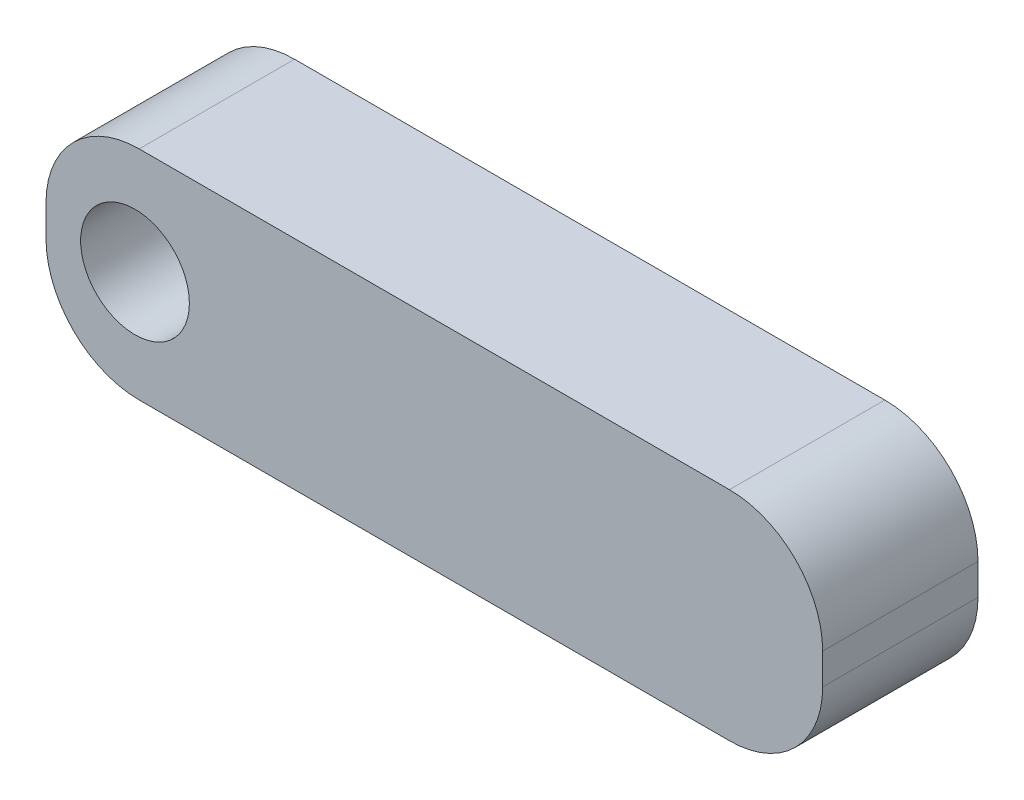
ISO-10303-21;
HEADER;
FILE_DESCRIPTION(('STEP AP214'),'2;1');
FILE_NAME('part.step','',(''),(''),'','','');
FILE_SCHEMA(('AUTOMOTIVE_DESIGN { 1 0 10303 214 1 1 1 1 }'));
ENDSEC;
DATA;
#1=APPLICATION_CONTEXT('core data for automotive mechanical design processes');
#2=APPLICATION_PROTOCOL_DEFINITION('international standard','automotive_design',2000,#1);
#3=PRODUCT_CONTEXT('',#1,'mechanical');
#4=PRODUCT('Part','Part','',(#3));
#5=PRODUCT_RELATED_PRODUCT_CATEGORY('part','',(#4));
#6=PRODUCT_DEFINITION_FORMATION('','',#4);
#7=PRODUCT_DEFINITION_CONTEXT('part definition',#1,'design');
#8=PRODUCT_DEFINITION('design','',#6,#7);
#9=PRODUCT_DEFINITION_SHAPE('','',#8);
#10=(LENGTH_UNIT() NAMED_UNIT(*) SI_UNIT(.MILLI.,.METRE.));
#11=(NAMED_UNIT(*) PLANE_ANGLE_UNIT() SI_UNIT($,.RADIAN.));
#12=(NAMED_UNIT(*) SI_UNIT($,.STERADIAN.) SOLID_ANGLE_UNIT());
#13=UNCERTAINTY_MEASURE_WITH_UNIT(LENGTH_MEASURE(1.E-05),#10,'distance_accuracy_value','');
#14=(GEOMETRIC_REPRESENTATION_CONTEXT(3) GLOBAL_UNCERTAINTY_ASSIGNED_CONTEXT((#13)) GLOBAL_UNIT_ASSIGNED_CONTEXT((#10,
#11,#12)) REPRESENTATION_CONTEXT('',''));
#15=CARTESIAN_POINT('',(0.,0.,0.));
#16=DIRECTION('',(0.,0.,1.));
#17=DIRECTION('',(1.,0.,0.));
#18=AXIS2_PLACEMENT_3D('',#15,#16,#17);
#19=CARTESIAN_POINT('',(0.,0.,5.));
#20=DIRECTION('',(0.,0.,-1.));
#21=DIRECTION('',(-1.,0.,0.));
#22=AXIS2_PLACEMENT_3D('',#19,#20,#21);
#23=PLANE('',#22);
#24=DIRECTION('',(0.,1.,0.));
#25=VECTOR('',#24,1.);
#26=CARTESIAN_POINT('',(12.5,-3.5,5.));
#27=LINE('',#26,#25);
#28=CARTESIAN_POINT('',(12.5,-0.5,5.));
#29=VERTEX_POINT('',#28);
#30=CARTESIAN_POINT('',(12.5,0.500000000000001,5.));
#31=VERTEX_POINT('',#30);
#32=EDGE_CURVE('E129',#29,#31,#27,.T.);
#33=ORIENTED_EDGE('',*,*,#32,.T.);
#34=CARTESIAN_POINT('',(9.50000000000001,0.500000000000001,5.));
#35=DIRECTION('',(0.,0.,-1.));
#36=DIRECTION('',(-1.,0.,0.));
#37=AXIS2_PLACEMENT_3D('',#34,#35,#36);
#38=CIRCLE('',#37,3.);
#39=CARTESIAN_POINT('',(9.50000000000001,3.5,5.));
#40=VERTEX_POINT('',#39);
#41=EDGE_CURVE('E41',#31,#40,#38,.F.);
#42=ORIENTED_EDGE('',*,*,#41,.T.);
#43=DIRECTION('',(-1.,0.,0.));
#44=VECTOR('',#43,1.);
#45=CARTESIAN_POINT('',(-12.5,3.5,5.));
#46=LINE('',#45,#44);
#47=CARTESIAN_POINT('',(-9.5,3.5,5.));
#48=VERTEX_POINT('',#47);
#49=EDGE_CURVE('E162',#40,#48,#46,.T.);
#50=ORIENTED_EDGE('',*,*,#49,.T.);
#51=CARTESIAN_POINT('',(-9.5,0.500000000000001,5.));
#52=DIRECTION('',(0.,0.,-1.));
#53=DIRECTION('',(-1.,0.,0.));
#54=AXIS2_PLACEMENT_3D('',#51,#52,#53);
#55=CIRCLE('',#54,3.);
#56=CARTESIAN_POINT('',(-12.5,0.500000000000001,5.));
#57=VERTEX_POINT('',#56);
#58=EDGE_CURVE('E141',#48,#57,#55,.F.);
#59=ORIENTED_EDGE('',*,*,#58,.T.);
#60=DIRECTION('',(0.,-1.,0.));
#61=VECTOR('',#60,1.);
#62=CARTESIAN_POINT('',(-12.5,-3.5,5.));
#63=LINE('',#62,#61);
#64=CARTESIAN_POINT('',(-12.5,-0.5,5.));
#65=VERTEX_POINT('',#64);
#66=EDGE_CURVE('E120',#57,#65,#63,.T.);
#67=ORIENTED_EDGE('',*,*,#66,.T.);
#68=CARTESIAN_POINT('',(-9.5,-0.5,5.));
#69=DIRECTION('',(0.,0.,-1.));
#70=DIRECTION('',(-1.,0.,0.));
#71=AXIS2_PLACEMENT_3D('',#68,#69,#70);
#72=CIRCLE('',#71,3.);
#73=CARTESIAN_POINT('',(-9.5,-3.5,5.));
#74=VERTEX_POINT('',#73);
#75=EDGE_CURVE('E139',#65,#74,#72,.F.);
#76=ORIENTED_EDGE('',*,*,#75,.T.);
#77=DIRECTION('',(1.,0.,0.));
#78=VECTOR('',#77,1.);
#79=CARTESIAN_POINT('',(-12.5,-3.5,5.));
#80=LINE('',#79,#78);
#81=CARTESIAN_POINT('',(9.50000000000001,-3.5,5.));
#82=VERTEX_POINT('',#81);
#83=EDGE_CURVE('E135',#74,#82,#80,.T.);
#84=ORIENTED_EDGE('',*,*,#83,.T.);
#85=CARTESIAN_POINT('',(9.50000000000001,-0.5,5.));
#86=DIRECTION('',(0.,0.,-1.));
#87=DIRECTION('',(-1.,0.,0.));
#88=AXIS2_PLACEMENT_3D('',#85,#86,#87);
#89=CIRCLE('',#88,3.);
#90=EDGE_CURVE('E157',#82,#29,#89,.F.);
#91=ORIENTED_EDGE('',*,*,#90,.T.);
#92=EDGE_LOOP('',(#33,#42,#50,#59,#67,#76,#84,#91));
#93=FACE_BOUND('',#92,.T.);
#94=CARTESIAN_POINT('',(-9.63541666666667,0.,5.));
#95=DIRECTION('',(0.,0.,1.));
#96=DIRECTION('',(1.,0.,0.));
#97=AXIS2_PLACEMENT_3D('',#94,#95,#96);
#98=CIRCLE('',#97,1.75);
#99=CARTESIAN_POINT('',(-7.88541666666667,0.,5.));
#100=VERTEX_POINT('',#99);
#101=EDGE_CURVE('E172',#100,#100,#98,.T.);
#102=ORIENTED_EDGE('',*,*,#101,.F.);
#103=EDGE_LOOP('',(#102));
#104=FACE_BOUND('',#103,.T.);
#105=ADVANCED_FACE('F33',(#93,#104),#23,.F.);
#106=CARTESIAN_POINT('',(0.,0.,0.));
#107=DIRECTION('',(0.,0.,-1.));
#108=DIRECTION('',(-1.,0.,0.));
#109=AXIS2_PLACEMENT_3D('',#106,#107,#108);
#110=PLANE('',#109);
#111=DIRECTION('',(-1.,0.,0.));
#112=VECTOR('',#111,1.);
#113=CARTESIAN_POINT('',(-12.5,3.5,0.));
#114=LINE('',#113,#112);
#115=CARTESIAN_POINT('',(9.50000000000001,3.5,0.));
#116=VERTEX_POINT('',#115);
#117=CARTESIAN_POINT('',(-9.5,3.5,0.));
#118=VERTEX_POINT('',#117);
#119=EDGE_CURVE('E127',#116,#118,#114,.T.);
#120=ORIENTED_EDGE('',*,*,#119,.F.);
#121=CARTESIAN_POINT('',(9.50000000000001,0.500000000000001,0.));
#122=DIRECTION('',(0.,0.,-1.));
#123=DIRECTION('',(-1.,0.,0.));
#124=AXIS2_PLACEMENT_3D('',#121,#122,#123);
#125=CIRCLE('',#124,3.);
#126=CARTESIAN_POINT('',(12.5,0.500000000000001,0.));
#127=VERTEX_POINT('',#126);
#128=EDGE_CURVE('E151',#116,#127,#125,.T.);
#129=ORIENTED_EDGE('',*,*,#128,.T.);
#130=DIRECTION('',(0.,1.,0.));
#131=VECTOR('',#130,1.);
#132=CARTESIAN_POINT('',(12.5,-3.5,0.));
#133=LINE('',#132,#131);
#134=CARTESIAN_POINT('',(12.5,-0.5,0.));
#135=VERTEX_POINT('',#134);
#136=EDGE_CURVE('E131',#135,#127,#133,.T.);
#137=ORIENTED_EDGE('',*,*,#136,.F.);
#138=CARTESIAN_POINT('',(9.50000000000001,-0.5,0.));
#139=DIRECTION('',(0.,0.,-1.));
#140=DIRECTION('',(-1.,0.,0.));
#141=AXIS2_PLACEMENT_3D('',#138,#139,#140);
#142=CIRCLE('',#141,3.);
#143=CARTESIAN_POINT('',(9.50000000000001,-3.5,0.));
#144=VERTEX_POINT('',#143);
#145=EDGE_CURVE('E149',#135,#144,#142,.T.);
#146=ORIENTED_EDGE('',*,*,#145,.T.);
#147=DIRECTION('',(1.,0.,0.));
#148=VECTOR('',#147,1.);
#149=CARTESIAN_POINT('',(-12.5,-3.5,0.));
#150=LINE('',#149,#148);
#151=CARTESIAN_POINT('',(-9.5,-3.5,0.));
#152=VERTEX_POINT('',#151);
#153=EDGE_CURVE('E126',#152,#144,#150,.T.);
#154=ORIENTED_EDGE('',*,*,#153,.F.);
#155=CARTESIAN_POINT('',(-9.5,-0.5,0.));
#156=DIRECTION('',(0.,0.,-1.));
#157=DIRECTION('',(-1.,0.,0.));
#158=AXIS2_PLACEMENT_3D('',#155,#156,#157);
#159=CIRCLE('',#158,3.);
#160=CARTESIAN_POINT('',(-12.5,-0.5,0.));
#161=VERTEX_POINT('',#160);
#162=EDGE_CURVE('E111',#152,#161,#159,.T.);
#163=ORIENTED_EDGE('',*,*,#162,.T.);
#164=DIRECTION('',(0.,-1.,0.));
#165=VECTOR('',#164,1.);
#166=CARTESIAN_POINT('',(-12.5,-3.5,0.));
#167=LINE('',#166,#165);
#168=CARTESIAN_POINT('',(-12.5,0.500000000000001,0.));
#169=VERTEX_POINT('',#168);
#170=EDGE_CURVE('E117',#169,#161,#167,.T.);
#171=ORIENTED_EDGE('',*,*,#170,.F.);
#172=CARTESIAN_POINT('',(-9.5,0.500000000000001,0.));
#173=DIRECTION('',(0.,0.,-1.));
#174=DIRECTION('',(-1.,0.,0.));
#175=AXIS2_PLACEMENT_3D('',#172,#173,#174);
#176=CIRCLE('',#175,3.);
#177=EDGE_CURVE('E101',#169,#118,#176,.T.);
#178=ORIENTED_EDGE('',*,*,#177,.T.);
#179=EDGE_LOOP('',(#120,#129,#137,#146,#154,#163,#171,#178));
#180=FACE_BOUND('',#179,.T.);
#181=CARTESIAN_POINT('',(-9.63541666666667,0.,0.));
#182=DIRECTION('',(0.,0.,1.));
#183=DIRECTION('',(1.,0.,0.));
#184=AXIS2_PLACEMENT_3D('',#181,#182,#183);
#185=CIRCLE('',#184,1.75);
#186=CARTESIAN_POINT('',(-7.88541666666667,0.,0.));
#187=VERTEX_POINT('',#186);
#188=EDGE_CURVE('E174',#187,#187,#185,.T.);
#189=ORIENTED_EDGE('',*,*,#188,.T.);
#190=EDGE_LOOP('',(#189));
#191=FACE_BOUND('',#190,.T.);
#192=ADVANCED_FACE('F123',(#180,#191),#110,.T.);
#193=CARTESIAN_POINT('',(12.5,-3.5,5.));
#194=DIRECTION('',(-1.,0.,0.));
#195=DIRECTION('',(0.,0.,1.));
#196=AXIS2_PLACEMENT_3D('',#193,#194,#195);
#197=PLANE('',#196);
#198=ORIENTED_EDGE('',*,*,#136,.T.);
#199=DIRECTION('',(0.,0.,-1.));
#200=VECTOR('',#199,1.);
#201=CARTESIAN_POINT('',(12.5,0.500000000000001,5.));
#202=LINE('',#201,#200);
#203=EDGE_CURVE('E54',#127,#31,#202,.F.);
#204=ORIENTED_EDGE('',*,*,#203,.T.);
#205=ORIENTED_EDGE('',*,*,#32,.F.);
#206=DIRECTION('',(0.,0.,-1.));
#207=VECTOR('',#206,1.);
#208=CARTESIAN_POINT('',(12.5,-0.5,5.));
#209=LINE('',#208,#207);
#210=EDGE_CURVE('E153',#29,#135,#209,.T.);
#211=ORIENTED_EDGE('',*,*,#210,.T.);
#212=EDGE_LOOP('',(#198,#204,#205,#211));
#213=FACE_BOUND('',#212,.T.);
#214=ADVANCED_FACE('F170',(#213),#197,.F.);
#215=CARTESIAN_POINT('',(-12.5,3.5,5.));
#216=DIRECTION('',(0.,-1.,0.));
#217=DIRECTION('',(0.,0.,-1.));
#218=AXIS2_PLACEMENT_3D('',#215,#216,#217);
#219=PLANE('',#218);
#220=ORIENTED_EDGE('',*,*,#49,.F.);
#221=DIRECTION('',(0.,0.,-1.));
#222=VECTOR('',#221,1.);
#223=CARTESIAN_POINT('',(9.50000000000001,3.5,5.));
#224=LINE('',#223,#222);
#225=EDGE_CURVE('E146',#40,#116,#224,.T.);
#226=ORIENTED_EDGE('',*,*,#225,.T.);
#227=ORIENTED_EDGE('',*,*,#119,.T.);
#228=DIRECTION('',(0.,0.,-1.));
#229=VECTOR('',#228,1.);
#230=CARTESIAN_POINT('',(-9.5,3.5,5.));
#231=LINE('',#230,#229);
#232=EDGE_CURVE('E107',#118,#48,#231,.F.);
#233=ORIENTED_EDGE('',*,*,#232,.T.);
#234=EDGE_LOOP('',(#220,#226,#227,#233));
#235=FACE_BOUND('',#234,.T.);
#236=ADVANCED_FACE('F166',(#235),#219,.F.);
#237=CARTESIAN_POINT('',(-12.5,-3.5,5.));
#238=DIRECTION('',(1.,0.,0.));
#239=DIRECTION('',(0.,0.,-1.));
#240=AXIS2_PLACEMENT_3D('',#237,#238,#239);
#241=PLANE('',#240);
#242=ORIENTED_EDGE('',*,*,#66,.F.);
#243=DIRECTION('',(0.,0.,-1.));
#244=VECTOR('',#243,1.);
#245=CARTESIAN_POINT('',(-12.5,0.500000000000001,5.));
#246=LINE('',#245,#244);
#247=EDGE_CURVE('E105',#57,#169,#246,.T.);
#248=ORIENTED_EDGE('',*,*,#247,.T.);
#249=ORIENTED_EDGE('',*,*,#170,.T.);
#250=DIRECTION('',(0.,0.,-1.));
#251=VECTOR('',#250,1.);
#252=CARTESIAN_POINT('',(-12.5,-0.5,5.));
#253=LINE('',#252,#251);
#254=EDGE_CURVE('E121',#161,#65,#253,.F.);
#255=ORIENTED_EDGE('',*,*,#254,.T.);
#256=EDGE_LOOP('',(#242,#248,#249,#255));
#257=FACE_BOUND('',#256,.T.);
#258=ADVANCED_FACE('F116',(#257),#241,.F.);
#259=CARTESIAN_POINT('',(-12.5,-3.5,5.));
#260=DIRECTION('',(0.,1.,0.));
#261=DIRECTION('',(0.,0.,1.));
#262=AXIS2_PLACEMENT_3D('',#259,#260,#261);
#263=PLANE('',#262);
#264=ORIENTED_EDGE('',*,*,#153,.T.);
#265=DIRECTION('',(0.,0.,-1.));
#266=VECTOR('',#265,1.);
#267=CARTESIAN_POINT('',(9.50000000000001,-3.5,5.));
#268=LINE('',#267,#266);
#269=EDGE_CURVE('E11',#144,#82,#268,.F.);
#270=ORIENTED_EDGE('',*,*,#269,.T.);
#271=ORIENTED_EDGE('',*,*,#83,.F.);
#272=DIRECTION('',(0.,0.,-1.));
#273=VECTOR('',#272,1.);
#274=CARTESIAN_POINT('',(-9.5,-3.5,5.));
#275=LINE('',#274,#273);
#276=EDGE_CURVE('E143',#74,#152,#275,.T.);
#277=ORIENTED_EDGE('',*,*,#276,.T.);
#278=EDGE_LOOP('',(#264,#270,#271,#277));
#279=FACE_BOUND('',#278,.T.);
#280=ADVANCED_FACE('F185',(#279),#263,.F.);
#281=CARTESIAN_POINT('',(-9.63541666666667,0.,5.));
#282=DIRECTION('',(0.,0.,-1.));
#283=DIRECTION('',(-1.,0.,0.));
#284=AXIS2_PLACEMENT_3D('',#281,#282,#283);
#285=CYLINDRICAL_SURFACE('',#284,1.75);
#286=ORIENTED_EDGE('',*,*,#101,.T.);
#287=EDGE_LOOP('',(#286));
#288=FACE_BOUND('',#287,.T.);
#289=ORIENTED_EDGE('',*,*,#188,.F.);
#290=EDGE_LOOP('',(#289));
#291=FACE_BOUND('',#290,.T.);
#292=ADVANCED_FACE('F183',(#288,#291),#285,.F.);
#293=CARTESIAN_POINT('',(-9.5,0.500000000000001,5.));
#294=DIRECTION('',(0.,0.,-1.));
#295=DIRECTION('',(-1.,0.,0.));
#296=AXIS2_PLACEMENT_3D('',#293,#294,#295);
#297=CYLINDRICAL_SURFACE('',#296,3.);
#298=ORIENTED_EDGE('',*,*,#58,.F.);
#299=ORIENTED_EDGE('',*,*,#232,.F.);
#300=ORIENTED_EDGE('',*,*,#177,.F.);
#301=ORIENTED_EDGE('',*,*,#247,.F.);
#302=EDGE_LOOP('',(#298,#299,#300,#301));
#303=FACE_BOUND('',#302,.T.);
#304=ADVANCED_FACE('F104',(#303),#297,.T.);
#305=CARTESIAN_POINT('',(-9.5,-0.5,5.));
#306=DIRECTION('',(0.,0.,-1.));
#307=DIRECTION('',(-1.,0.,0.));
#308=AXIS2_PLACEMENT_3D('',#305,#306,#307);
#309=CYLINDRICAL_SURFACE('',#308,3.);
#310=ORIENTED_EDGE('',*,*,#75,.F.);
#311=ORIENTED_EDGE('',*,*,#254,.F.);
#312=ORIENTED_EDGE('',*,*,#162,.F.);
#313=ORIENTED_EDGE('',*,*,#276,.F.);
#314=EDGE_LOOP('',(#310,#311,#312,#313));
#315=FACE_BOUND('',#314,.T.);
#316=ADVANCED_FACE('F192',(#315),#309,.T.);
#317=CARTESIAN_POINT('',(9.50000000000001,0.500000000000001,5.));
#318=DIRECTION('',(0.,0.,-1.));
#319=DIRECTION('',(-1.,0.,0.));
#320=AXIS2_PLACEMENT_3D('',#317,#318,#319);
#321=CYLINDRICAL_SURFACE('',#320,3.);
#322=ORIENTED_EDGE('',*,*,#41,.F.);
#323=ORIENTED_EDGE('',*,*,#203,.F.);
#324=ORIENTED_EDGE('',*,*,#128,.F.);
#325=ORIENTED_EDGE('',*,*,#225,.F.);
#326=EDGE_LOOP('',(#322,#323,#324,#325));
#327=FACE_BOUND('',#326,.T.);
#328=ADVANCED_FACE('F168',(#327),#321,.T.);
#329=CARTESIAN_POINT('',(9.50000000000001,-0.5,5.));
#330=DIRECTION('',(0.,0.,-1.));
#331=DIRECTION('',(-1.,0.,0.));
#332=AXIS2_PLACEMENT_3D('',#329,#330,#331);
#333=CYLINDRICAL_SURFACE('',#332,3.);
#334=ORIENTED_EDGE('',*,*,#90,.F.);
#335=ORIENTED_EDGE('',*,*,#269,.F.);
#336=ORIENTED_EDGE('',*,*,#145,.F.);
#337=ORIENTED_EDGE('',*,*,#210,.F.);
#338=EDGE_LOOP('',(#334,#335,#336,#337));
#339=FACE_BOUND('',#338,.T.);
#340=ADVANCED_FACE('F35',(#339),#333,.T.);
#341=CLOSED_SHELL('',(#105,#192,#214,#236,#258,#280,#292,#304,#316,#328,#340));
#342=MANIFOLD_SOLID_BREP('B2',#341);
#343=ADVANCED_BREP_SHAPE_REPRESENTATION('',(#18,#342),#14);
#344=SHAPE_DEFINITION_REPRESENTATION(#9,#343);
ENDSEC;
END-ISO-10303-21;
